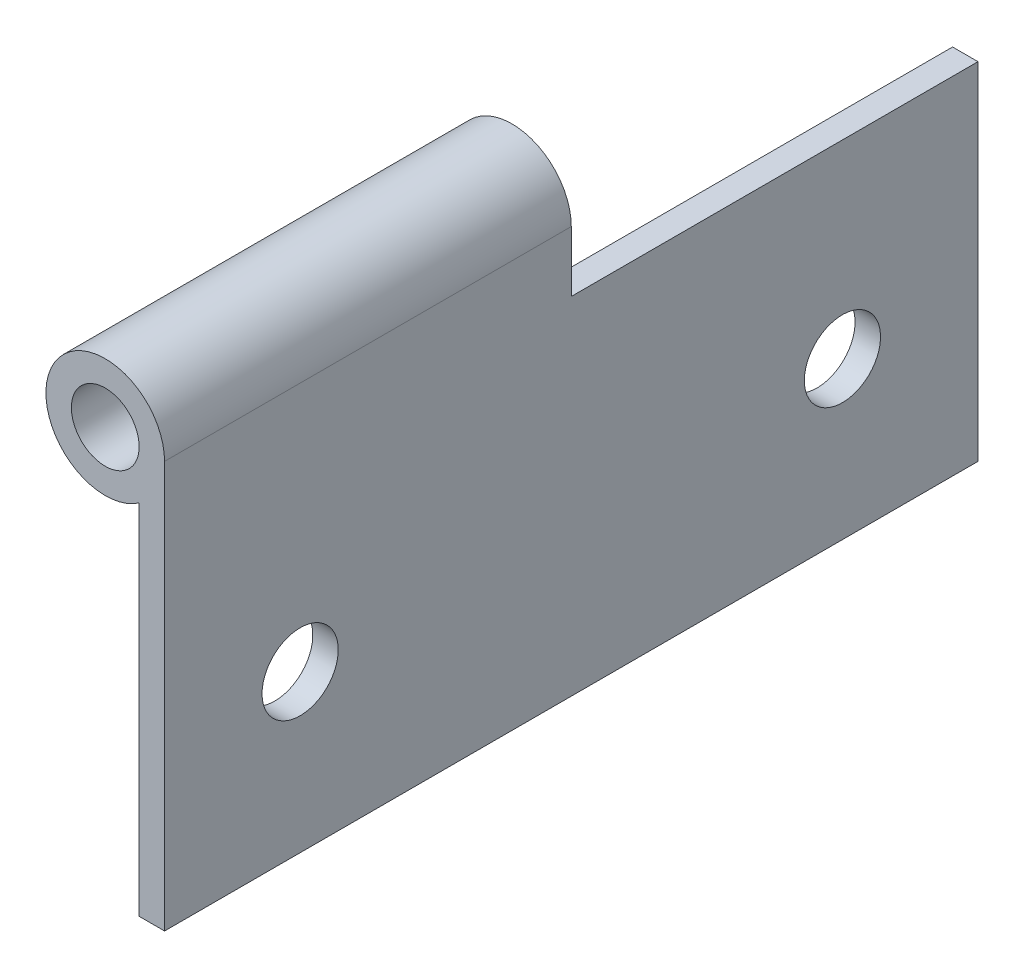
ISO-10303-21;
HEADER;
FILE_DESCRIPTION(('STEP AP214'),'2;1');
FILE_NAME('part.step','',(''),(''),'','','');
FILE_SCHEMA(('AUTOMOTIVE_DESIGN { 1 0 10303 214 1 1 1 1 }'));
ENDSEC;
DATA;
#1=APPLICATION_CONTEXT('core data for automotive mechanical design processes');
#2=APPLICATION_PROTOCOL_DEFINITION('international standard','automotive_design',2000,#1);
#3=PRODUCT_CONTEXT('',#1,'mechanical');
#4=PRODUCT('Part','Part','',(#3));
#5=PRODUCT_RELATED_PRODUCT_CATEGORY('part','',(#4));
#6=PRODUCT_DEFINITION_FORMATION('','',#4);
#7=PRODUCT_DEFINITION_CONTEXT('part definition',#1,'design');
#8=PRODUCT_DEFINITION('design','',#6,#7);
#9=PRODUCT_DEFINITION_SHAPE('','',#8);
#10=(LENGTH_UNIT() NAMED_UNIT(*) SI_UNIT(.MILLI.,.METRE.));
#11=(NAMED_UNIT(*) PLANE_ANGLE_UNIT() SI_UNIT($,.RADIAN.));
#12=(NAMED_UNIT(*) SI_UNIT($,.STERADIAN.) SOLID_ANGLE_UNIT());
#13=UNCERTAINTY_MEASURE_WITH_UNIT(LENGTH_MEASURE(1.E-05),#10,'distance_accuracy_value','');
#14=(GEOMETRIC_REPRESENTATION_CONTEXT(3) GLOBAL_UNCERTAINTY_ASSIGNED_CONTEXT((#13)) GLOBAL_UNIT_ASSIGNED_CONTEXT((#10,
#11,#12)) REPRESENTATION_CONTEXT('',''));
#15=CARTESIAN_POINT('',(0.,0.,0.));
#16=DIRECTION('',(0.,0.,1.));
#17=DIRECTION('',(1.,0.,0.));
#18=AXIS2_PLACEMENT_3D('',#15,#16,#17);
#19=CARTESIAN_POINT('',(208.728194429075,94.5017138000006,0.));
#20=DIRECTION('',(0.,0.,1.));
#21=DIRECTION('',(1.,0.,0.));
#22=AXIS2_PLACEMENT_3D('',#19,#20,#21);
#23=PLANE('',#22);
#24=CARTESIAN_POINT('',(208.728194429075,94.5017138000006,0.));
#25=DIRECTION('',(0.,0.,1.));
#26=DIRECTION('',(1.,0.,0.));
#27=AXIS2_PLACEMENT_3D('',#24,#25,#26);
#28=CIRCLE('',#27,3.175);
#29=CARTESIAN_POINT('',(211.903194429075,94.5017138000006,0.));
#30=VERTEX_POINT('',#29);
#31=EDGE_CURVE('E116',#30,#30,#28,.T.);
#32=ORIENTED_EDGE('',*,*,#31,.T.);
#33=EDGE_LOOP('',(#32));
#34=FACE_BOUND('',#33,.T.);
#35=DIRECTION('',(1.,0.,0.));
#36=VECTOR('',#35,1.);
#37=CARTESIAN_POINT('',(211.9040212,88.8294161347208,0.));
#38=LINE('',#37,#36);
#39=CARTESIAN_POINT('',(211.9040212,88.8294161347208,0.));
#40=VERTEX_POINT('',#39);
#41=CARTESIAN_POINT('',(214.284444429075,88.8294161347208,0.));
#42=VERTEX_POINT('',#41);
#43=EDGE_CURVE('E48',#40,#42,#38,.T.);
#44=ORIENTED_EDGE('',*,*,#43,.F.);
#45=DIRECTION('',(0.,-1.,0.));
#46=VECTOR('',#45,1.);
#47=CARTESIAN_POINT('',(211.9040212,56.4017138000006,0.));
#48=LINE('',#47,#46);
#49=CARTESIAN_POINT('',(211.9040212,89.942543,0.));
#50=VERTEX_POINT('',#49);
#51=EDGE_CURVE('E139',#50,#40,#48,.T.);
#52=ORIENTED_EDGE('',*,*,#51,.F.);
#53=CARTESIAN_POINT('',(208.728194429075,94.5017138000006,0.));
#54=DIRECTION('',(0.,0.,1.));
#55=DIRECTION('',(1.,0.,0.));
#56=AXIS2_PLACEMENT_3D('',#53,#54,#55);
#57=CIRCLE('',#56,5.55624999999999);
#58=CARTESIAN_POINT('',(214.284444429075,94.5017138000006,0.));
#59=VERTEX_POINT('',#58);
#60=EDGE_CURVE('E73',#59,#50,#57,.T.);
#61=ORIENTED_EDGE('',*,*,#60,.F.);
#62=DIRECTION('',(0.,1.,0.));
#63=VECTOR('',#62,1.);
#64=CARTESIAN_POINT('',(214.284444429075,56.4017138000006,0.));
#65=LINE('',#64,#63);
#66=EDGE_CURVE('E124',#42,#59,#65,.T.);
#67=ORIENTED_EDGE('',*,*,#66,.F.);
#68=EDGE_LOOP('',(#44,#52,#61,#67));
#69=FACE_BOUND('',#68,.T.);
#70=ADVANCED_FACE('F31',(#34,#69),#23,.F.);
#71=CARTESIAN_POINT('',(208.728194429075,94.5017138000006,38.1));
#72=DIRECTION('',(0.,0.,1.));
#73=DIRECTION('',(1.,0.,0.));
#74=AXIS2_PLACEMENT_3D('',#71,#72,#73);
#75=PLANE('',#74);
#76=DIRECTION('',(1.,0.,0.));
#77=VECTOR('',#76,1.);
#78=CARTESIAN_POINT('',(211.9040212,56.4017138000006,38.1));
#79=LINE('',#78,#77);
#80=CARTESIAN_POINT('',(211.9040212,56.4017138000006,38.1));
#81=VERTEX_POINT('',#80);
#82=CARTESIAN_POINT('',(214.284444429075,56.4017138000006,38.1));
#83=VERTEX_POINT('',#82);
#84=EDGE_CURVE('E137',#81,#83,#79,.T.);
#85=ORIENTED_EDGE('',*,*,#84,.T.);
#86=DIRECTION('',(0.,1.,0.));
#87=VECTOR('',#86,1.);
#88=CARTESIAN_POINT('',(214.284444429075,56.4017138000006,38.1));
#89=LINE('',#88,#87);
#90=CARTESIAN_POINT('',(214.284444429075,94.5017138000006,38.1));
#91=VERTEX_POINT('',#90);
#92=EDGE_CURVE('E80',#83,#91,#89,.T.);
#93=ORIENTED_EDGE('',*,*,#92,.T.);
#94=CARTESIAN_POINT('',(208.728194429075,94.5017138000006,38.1));
#95=DIRECTION('',(0.,0.,1.));
#96=DIRECTION('',(1.,0.,0.));
#97=AXIS2_PLACEMENT_3D('',#94,#95,#96);
#98=CIRCLE('',#97,5.55624999999999);
#99=CARTESIAN_POINT('',(211.9040212,89.942543,38.1));
#100=VERTEX_POINT('',#99);
#101=EDGE_CURVE('E141',#91,#100,#98,.T.);
#102=ORIENTED_EDGE('',*,*,#101,.T.);
#103=DIRECTION('',(0.,-1.,0.));
#104=VECTOR('',#103,1.);
#105=CARTESIAN_POINT('',(211.9040212,56.4017138000006,38.1));
#106=LINE('',#105,#104);
#107=EDGE_CURVE('E57',#100,#81,#106,.T.);
#108=ORIENTED_EDGE('',*,*,#107,.T.);
#109=EDGE_LOOP('',(#85,#93,#102,#108));
#110=FACE_BOUND('',#109,.T.);
#111=CARTESIAN_POINT('',(208.728194429075,94.5017138000006,38.1));
#112=DIRECTION('',(0.,0.,1.));
#113=DIRECTION('',(1.,0.,0.));
#114=AXIS2_PLACEMENT_3D('',#111,#112,#113);
#115=CIRCLE('',#114,3.175);
#116=CARTESIAN_POINT('',(211.903194429075,94.5017138000006,38.1));
#117=VERTEX_POINT('',#116);
#118=EDGE_CURVE('E120',#117,#117,#115,.T.);
#119=ORIENTED_EDGE('',*,*,#118,.F.);
#120=EDGE_LOOP('',(#119));
#121=FACE_BOUND('',#120,.T.);
#122=ADVANCED_FACE('F158',(#110,#121),#75,.T.);
#123=CARTESIAN_POINT('',(211.9040212,56.4017138000006,38.1));
#124=DIRECTION('',(0.,1.,0.));
#125=DIRECTION('',(0.,0.,1.));
#126=AXIS2_PLACEMENT_3D('',#123,#124,#125);
#127=PLANE('',#126);
#128=DIRECTION('',(0.,0.,-1.));
#129=VECTOR('',#128,1.);
#130=CARTESIAN_POINT('',(211.9040212,56.4017138000006,38.1));
#131=LINE('',#130,#129);
#132=CARTESIAN_POINT('',(211.9040212,56.4017138000006,-38.1));
#133=VERTEX_POINT('',#132);
#134=EDGE_CURVE('E143',#81,#133,#131,.T.);
#135=ORIENTED_EDGE('',*,*,#134,.T.);
#136=DIRECTION('',(-1.,0.,0.));
#137=VECTOR('',#136,1.);
#138=CARTESIAN_POINT('',(214.284444429075,56.4017138000006,-38.1));
#139=LINE('',#138,#137);
#140=CARTESIAN_POINT('',(214.284444429075,56.4017138000006,-38.1));
#141=VERTEX_POINT('',#140);
#142=EDGE_CURVE('E104',#141,#133,#139,.T.);
#143=ORIENTED_EDGE('',*,*,#142,.F.);
#144=DIRECTION('',(0.,0.,-1.));
#145=VECTOR('',#144,1.);
#146=CARTESIAN_POINT('',(214.284444429075,56.4017138000006,38.1));
#147=LINE('',#146,#145);
#148=EDGE_CURVE('E11',#83,#141,#147,.T.);
#149=ORIENTED_EDGE('',*,*,#148,.F.);
#150=ORIENTED_EDGE('',*,*,#84,.F.);
#151=EDGE_LOOP('',(#135,#143,#149,#150));
#152=FACE_BOUND('',#151,.T.);
#153=ADVANCED_FACE('F33',(#152),#127,.F.);
#154=CARTESIAN_POINT('',(214.284444429075,56.4017138000006,38.1));
#155=DIRECTION('',(-1.,0.,0.));
#156=DIRECTION('',(0.,0.,1.));
#157=AXIS2_PLACEMENT_3D('',#154,#155,#156);
#158=PLANE('',#157);
#159=CARTESIAN_POINT('',(214.284444429075,71.0829138000006,25.4));
#160=DIRECTION('',(-1.,0.,0.));
#161=DIRECTION('',(0.,0.,1.));
#162=AXIS2_PLACEMENT_3D('',#159,#160,#161);
#163=CIRCLE('',#162,3.5687);
#164=CARTESIAN_POINT('',(214.284444429075,71.0829138000006,28.9687));
#165=VERTEX_POINT('',#164);
#166=EDGE_CURVE('E187',#165,#165,#163,.F.);
#167=ORIENTED_EDGE('',*,*,#166,.F.);
#168=EDGE_LOOP('',(#167));
#169=FACE_BOUND('',#168,.T.);
#170=CARTESIAN_POINT('',(214.284444429075,71.0829138000006,-25.4));
#171=DIRECTION('',(-1.,0.,0.));
#172=DIRECTION('',(0.,0.,1.));
#173=AXIS2_PLACEMENT_3D('',#170,#171,#172);
#174=CIRCLE('',#173,3.5687);
#175=CARTESIAN_POINT('',(214.284444429075,71.0829138000006,-21.8313));
#176=VERTEX_POINT('',#175);
#177=EDGE_CURVE('E130',#176,#176,#174,.F.);
#178=ORIENTED_EDGE('',*,*,#177,.F.);
#179=EDGE_LOOP('',(#178));
#180=FACE_BOUND('',#179,.T.);
#181=ORIENTED_EDGE('',*,*,#148,.T.);
#182=DIRECTION('',(0.,-1.,0.));
#183=VECTOR('',#182,1.);
#184=CARTESIAN_POINT('',(214.284444429075,88.8294161347208,-38.1));
#185=LINE('',#184,#183);
#186=CARTESIAN_POINT('',(214.284444429075,88.8294161347208,-38.1));
#187=VERTEX_POINT('',#186);
#188=EDGE_CURVE('E95',#187,#141,#185,.T.);
#189=ORIENTED_EDGE('',*,*,#188,.F.);
#190=DIRECTION('',(0.,0.,1.));
#191=VECTOR('',#190,1.);
#192=CARTESIAN_POINT('',(214.284444429075,88.8294161347208,-38.1));
#193=LINE('',#192,#191);
#194=EDGE_CURVE('E99',#187,#42,#193,.T.);
#195=ORIENTED_EDGE('',*,*,#194,.T.);
#196=ORIENTED_EDGE('',*,*,#66,.T.);
#197=DIRECTION('',(0.,0.,-1.));
#198=VECTOR('',#197,1.);
#199=CARTESIAN_POINT('',(214.284444429075,94.5017138000006,38.1));
#200=LINE('',#199,#198);
#201=EDGE_CURVE('E40',#91,#59,#200,.T.);
#202=ORIENTED_EDGE('',*,*,#201,.F.);
#203=ORIENTED_EDGE('',*,*,#92,.F.);
#204=EDGE_LOOP('',(#181,#189,#195,#196,#202,#203));
#205=FACE_BOUND('',#204,.T.);
#206=ADVANCED_FACE('F97',(#169,#180,#205),#158,.F.);
#207=CARTESIAN_POINT('',(208.728194429075,94.5017138000006,38.1));
#208=DIRECTION('',(0.,0.,-1.));
#209=DIRECTION('',(-1.,0.,0.));
#210=AXIS2_PLACEMENT_3D('',#207,#208,#209);
#211=CYLINDRICAL_SURFACE('',#210,5.55624999999999);
#212=ORIENTED_EDGE('',*,*,#60,.T.);
#213=DIRECTION('',(0.,0.,-1.));
#214=VECTOR('',#213,1.);
#215=CARTESIAN_POINT('',(211.9040212,89.942543,38.1));
#216=LINE('',#215,#214);
#217=EDGE_CURVE('E151',#100,#50,#216,.T.);
#218=ORIENTED_EDGE('',*,*,#217,.F.);
#219=ORIENTED_EDGE('',*,*,#101,.F.);
#220=ORIENTED_EDGE('',*,*,#201,.T.);
#221=EDGE_LOOP('',(#212,#218,#219,#220));
#222=FACE_BOUND('',#221,.T.);
#223=ADVANCED_FACE('F157',(#222),#211,.T.);
#224=CARTESIAN_POINT('',(211.9040212,56.4017138000006,38.1));
#225=DIRECTION('',(1.,0.,0.));
#226=DIRECTION('',(0.,0.,-1.));
#227=AXIS2_PLACEMENT_3D('',#224,#225,#226);
#228=PLANE('',#227);
#229=CARTESIAN_POINT('',(211.9040212,71.0829138000006,25.4));
#230=DIRECTION('',(-1.,0.,0.));
#231=DIRECTION('',(0.,0.,1.));
#232=AXIS2_PLACEMENT_3D('',#229,#230,#231);
#233=CIRCLE('',#232,3.5687);
#234=CARTESIAN_POINT('',(211.9040212,71.0829138000006,28.9687));
#235=VERTEX_POINT('',#234);
#236=EDGE_CURVE('E197',#235,#235,#233,.T.);
#237=ORIENTED_EDGE('',*,*,#236,.F.);
#238=EDGE_LOOP('',(#237));
#239=FACE_BOUND('',#238,.T.);
#240=CARTESIAN_POINT('',(211.9040212,71.0829138000006,-25.4));
#241=DIRECTION('',(-1.,0.,0.));
#242=DIRECTION('',(0.,0.,1.));
#243=AXIS2_PLACEMENT_3D('',#240,#241,#242);
#244=CIRCLE('',#243,3.5687);
#245=CARTESIAN_POINT('',(211.9040212,71.0829138000006,-21.8313));
#246=VERTEX_POINT('',#245);
#247=EDGE_CURVE('E191',#246,#246,#244,.T.);
#248=ORIENTED_EDGE('',*,*,#247,.F.);
#249=EDGE_LOOP('',(#248));
#250=FACE_BOUND('',#249,.T.);
#251=ORIENTED_EDGE('',*,*,#51,.T.);
#252=DIRECTION('',(0.,0.,1.));
#253=VECTOR('',#252,1.);
#254=CARTESIAN_POINT('',(211.9040212,88.8294161347208,-38.1));
#255=LINE('',#254,#253);
#256=CARTESIAN_POINT('',(211.9040212,88.8294161347208,-38.1));
#257=VERTEX_POINT('',#256);
#258=EDGE_CURVE('E117',#257,#40,#255,.T.);
#259=ORIENTED_EDGE('',*,*,#258,.F.);
#260=DIRECTION('',(0.,1.,0.));
#261=VECTOR('',#260,1.);
#262=CARTESIAN_POINT('',(211.9040212,56.4017138000006,-38.1));
#263=LINE('',#262,#261);
#264=EDGE_CURVE('E110',#133,#257,#263,.T.);
#265=ORIENTED_EDGE('',*,*,#264,.F.);
#266=ORIENTED_EDGE('',*,*,#134,.F.);
#267=ORIENTED_EDGE('',*,*,#107,.F.);
#268=ORIENTED_EDGE('',*,*,#217,.T.);
#269=EDGE_LOOP('',(#251,#259,#265,#266,#267,#268));
#270=FACE_BOUND('',#269,.T.);
#271=ADVANCED_FACE('F155',(#239,#250,#270),#228,.F.);
#272=CARTESIAN_POINT('',(208.728194429075,94.5017138000006,38.1));
#273=DIRECTION('',(0.,0.,-1.));
#274=DIRECTION('',(-1.,0.,0.));
#275=AXIS2_PLACEMENT_3D('',#272,#273,#274);
#276=CYLINDRICAL_SURFACE('',#275,3.175);
#277=ORIENTED_EDGE('',*,*,#118,.T.);
#278=EDGE_LOOP('',(#277));
#279=FACE_BOUND('',#278,.T.);
#280=ORIENTED_EDGE('',*,*,#31,.F.);
#281=EDGE_LOOP('',(#280));
#282=FACE_BOUND('',#281,.T.);
#283=ADVANCED_FACE('F164',(#279,#282),#276,.F.);
#284=CARTESIAN_POINT('',(211.9040212,88.8294161347208,-38.1));
#285=DIRECTION('',(0.,-1.,0.));
#286=DIRECTION('',(0.,0.,-1.));
#287=AXIS2_PLACEMENT_3D('',#284,#285,#286);
#288=PLANE('',#287);
#289=ORIENTED_EDGE('',*,*,#43,.T.);
#290=ORIENTED_EDGE('',*,*,#194,.F.);
#291=DIRECTION('',(1.,0.,0.));
#292=VECTOR('',#291,1.);
#293=CARTESIAN_POINT('',(211.9040212,88.8294161347208,-38.1));
#294=LINE('',#293,#292);
#295=EDGE_CURVE('E105',#257,#187,#294,.T.);
#296=ORIENTED_EDGE('',*,*,#295,.F.);
#297=ORIENTED_EDGE('',*,*,#258,.T.);
#298=EDGE_LOOP('',(#289,#290,#296,#297));
#299=FACE_BOUND('',#298,.T.);
#300=ADVANCED_FACE('F115',(#299),#288,.F.);
#301=CARTESIAN_POINT('',(214.284444429075,88.8294161347208,-38.1));
#302=DIRECTION('',(0.,0.,-1.));
#303=DIRECTION('',(-1.,0.,0.));
#304=AXIS2_PLACEMENT_3D('',#301,#302,#303);
#305=PLANE('',#304);
#306=ORIENTED_EDGE('',*,*,#295,.T.);
#307=ORIENTED_EDGE('',*,*,#188,.T.);
#308=ORIENTED_EDGE('',*,*,#142,.T.);
#309=ORIENTED_EDGE('',*,*,#264,.T.);
#310=EDGE_LOOP('',(#306,#307,#308,#309));
#311=FACE_BOUND('',#310,.T.);
#312=ADVANCED_FACE('F108',(#311),#305,.T.);
#313=CARTESIAN_POINT('',(224.378252309157,71.0829138000006,-25.4));
#314=DIRECTION('',(-1.,0.,0.));
#315=DIRECTION('',(0.,0.,1.));
#316=AXIS2_PLACEMENT_3D('',#313,#314,#315);
#317=CYLINDRICAL_SURFACE('',#316,3.5687);
#318=ORIENTED_EDGE('',*,*,#177,.T.);
#319=EDGE_LOOP('',(#318));
#320=FACE_BOUND('',#319,.T.);
#321=ORIENTED_EDGE('',*,*,#247,.T.);
#322=EDGE_LOOP('',(#321));
#323=FACE_BOUND('',#322,.T.);
#324=ADVANCED_FACE('F205',(#320,#323),#317,.F.);
#325=CARTESIAN_POINT('',(224.378252309157,71.0829138000006,25.4));
#326=DIRECTION('',(-1.,0.,0.));
#327=DIRECTION('',(0.,0.,1.));
#328=AXIS2_PLACEMENT_3D('',#325,#326,#327);
#329=CYLINDRICAL_SURFACE('',#328,3.5687);
#330=ORIENTED_EDGE('',*,*,#166,.T.);
#331=EDGE_LOOP('',(#330));
#332=FACE_BOUND('',#331,.T.);
#333=ORIENTED_EDGE('',*,*,#236,.T.);
#334=EDGE_LOOP('',(#333));
#335=FACE_BOUND('',#334,.T.);
#336=ADVANCED_FACE('F201',(#332,#335),#329,.F.);
#337=CLOSED_SHELL('',(#70,#122,#153,#206,#223,#271,#283,#300,#312,#324,#336));
#338=MANIFOLD_SOLID_BREP('B2',#337);
#339=ADVANCED_BREP_SHAPE_REPRESENTATION('',(#18,#338),#14);
#340=SHAPE_DEFINITION_REPRESENTATION(#9,#339);
ENDSEC;
END-ISO-10303-21;
